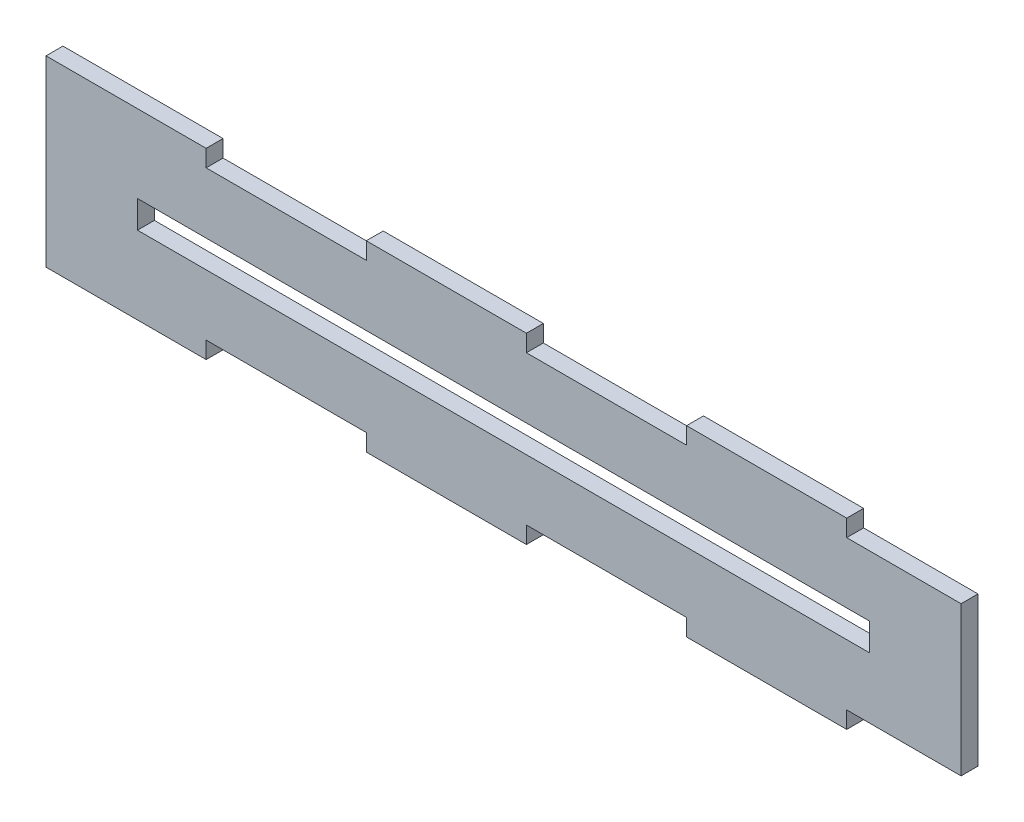
ISO-10303-21;
HEADER;
FILE_DESCRIPTION(('STEP AP214'),'2;1');
FILE_NAME('part.step','',(''),(''),'','','');
FILE_SCHEMA(('AUTOMOTIVE_DESIGN { 1 0 10303 214 1 1 1 1 }'));
ENDSEC;
DATA;
#1=APPLICATION_CONTEXT('core data for automotive mechanical design processes');
#2=APPLICATION_PROTOCOL_DEFINITION('international standard','automotive_design',2000,#1);
#3=PRODUCT_CONTEXT('',#1,'mechanical');
#4=PRODUCT('Part','Part','',(#3));
#5=PRODUCT_RELATED_PRODUCT_CATEGORY('part','',(#4));
#6=PRODUCT_DEFINITION_FORMATION('','',#4);
#7=PRODUCT_DEFINITION_CONTEXT('part definition',#1,'design');
#8=PRODUCT_DEFINITION('design','',#6,#7);
#9=PRODUCT_DEFINITION_SHAPE('','',#8);
#10=(LENGTH_UNIT() NAMED_UNIT(*) SI_UNIT(.MILLI.,.METRE.));
#11=(NAMED_UNIT(*) PLANE_ANGLE_UNIT() SI_UNIT($,.RADIAN.));
#12=(NAMED_UNIT(*) SI_UNIT($,.STERADIAN.) SOLID_ANGLE_UNIT());
#13=UNCERTAINTY_MEASURE_WITH_UNIT(LENGTH_MEASURE(1.E-05),#10,'distance_accuracy_value','');
#14=(GEOMETRIC_REPRESENTATION_CONTEXT(3) GLOBAL_UNCERTAINTY_ASSIGNED_CONTEXT((#13)) GLOBAL_UNIT_ASSIGNED_CONTEXT((#10,
#11,#12)) REPRESENTATION_CONTEXT('',''));
#15=CARTESIAN_POINT('',(0.,0.,0.));
#16=DIRECTION('',(0.,0.,1.));
#17=DIRECTION('',(1.,0.,0.));
#18=AXIS2_PLACEMENT_3D('',#15,#16,#17);
#19=CARTESIAN_POINT('',(0.,0.,0.));
#20=DIRECTION('',(0.,0.,1.));
#21=DIRECTION('',(1.,0.,0.));
#22=AXIS2_PLACEMENT_3D('',#19,#20,#21);
#23=PLANE('',#22);
#24=DIRECTION('',(-1.,0.,0.));
#25=VECTOR('',#24,1.);
#26=CARTESIAN_POINT('',(106.792884167343,-158.153737527389,0.));
#27=LINE('',#26,#25);
#28=CARTESIAN_POINT('',(309.992884167343,-158.153737527389,0.));
#29=VERTEX_POINT('',#28);
#30=CARTESIAN_POINT('',(106.792884167343,-158.153737527389,0.));
#31=VERTEX_POINT('',#30);
#32=EDGE_CURVE('E409',#29,#31,#27,.T.);
#33=ORIENTED_EDGE('',*,*,#32,.F.);
#34=DIRECTION('',(0.,-1.,0.));
#35=VECTOR('',#34,1.);
#36=CARTESIAN_POINT('',(309.992884167343,-150.533737527389,0.));
#37=LINE('',#36,#35);
#38=CARTESIAN_POINT('',(309.992884167343,-150.533737527389,0.));
#39=VERTEX_POINT('',#38);
#40=EDGE_CURVE('E393',#39,#29,#37,.T.);
#41=ORIENTED_EDGE('',*,*,#40,.F.);
#42=DIRECTION('',(1.,0.,0.));
#43=VECTOR('',#42,1.);
#44=CARTESIAN_POINT('',(106.792884167343,-150.533737527389,0.));
#45=LINE('',#44,#43);
#46=CARTESIAN_POINT('',(106.792884167343,-150.533737527389,0.));
#47=VERTEX_POINT('',#46);
#48=EDGE_CURVE('E398',#47,#39,#45,.T.);
#49=ORIENTED_EDGE('',*,*,#48,.F.);
#50=DIRECTION('',(0.,1.,0.));
#51=VECTOR('',#50,1.);
#52=CARTESIAN_POINT('',(106.792884167343,-150.533737527389,0.));
#53=LINE('',#52,#51);
#54=EDGE_CURVE('E412',#31,#47,#53,.T.);
#55=ORIENTED_EDGE('',*,*,#54,.F.);
#56=EDGE_LOOP('',(#33,#41,#49,#55));
#57=FACE_BOUND('',#56,.T.);
#58=DIRECTION('',(0.,1.,0.));
#59=VECTOR('',#58,1.);
#60=CARTESIAN_POINT('',(125.842884167343,-133.642737527389,0.));
#61=LINE('',#60,#59);
#62=CARTESIAN_POINT('',(125.842884167343,-133.642737527389,0.));
#63=VERTEX_POINT('',#62);
#64=CARTESIAN_POINT('',(125.842884167343,-128.943737527389,0.));
#65=VERTEX_POINT('',#64);
#66=EDGE_CURVE('E327',#63,#65,#61,.T.);
#67=ORIENTED_EDGE('',*,*,#66,.F.);
#68=DIRECTION('',(1.,0.,0.));
#69=VECTOR('',#68,1.);
#70=CARTESIAN_POINT('',(81.3928841673428,-133.642737527389,0.));
#71=LINE('',#70,#69);
#72=CARTESIAN_POINT('',(170.292884167343,-133.642737527389,0.));
#73=VERTEX_POINT('',#72);
#74=EDGE_CURVE('E330',#63,#73,#71,.T.);
#75=ORIENTED_EDGE('',*,*,#74,.T.);
#76=DIRECTION('',(0.,1.,0.));
#77=VECTOR('',#76,1.);
#78=CARTESIAN_POINT('',(170.292884167343,-133.642737527389,0.));
#79=LINE('',#78,#77);
#80=CARTESIAN_POINT('',(170.292884167343,-128.943737527389,0.));
#81=VERTEX_POINT('',#80);
#82=EDGE_CURVE('E315',#73,#81,#79,.T.);
#83=ORIENTED_EDGE('',*,*,#82,.T.);
#84=DIRECTION('',(1.,0.,0.));
#85=VECTOR('',#84,1.);
#86=CARTESIAN_POINT('',(81.392884167343,-128.943737527389,0.));
#87=LINE('',#86,#85);
#88=CARTESIAN_POINT('',(214.742884167343,-128.943737527389,0.));
#89=VERTEX_POINT('',#88);
#90=EDGE_CURVE('E278',#81,#89,#87,.T.);
#91=ORIENTED_EDGE('',*,*,#90,.T.);
#92=DIRECTION('',(0.,1.,0.));
#93=VECTOR('',#92,1.);
#94=CARTESIAN_POINT('',(214.742884167343,-133.642737527389,0.));
#95=LINE('',#94,#93);
#96=CARTESIAN_POINT('',(214.742884167343,-133.642737527389,0.));
#97=VERTEX_POINT('',#96);
#98=EDGE_CURVE('E319',#97,#89,#95,.T.);
#99=ORIENTED_EDGE('',*,*,#98,.F.);
#100=CARTESIAN_POINT('',(259.192884167343,-133.642737527389,0.));
#101=VERTEX_POINT('',#100);
#102=EDGE_CURVE('E299',#97,#101,#71,.T.);
#103=ORIENTED_EDGE('',*,*,#102,.T.);
#104=DIRECTION('',(0.,1.,0.));
#105=VECTOR('',#104,1.);
#106=CARTESIAN_POINT('',(259.192884167343,-133.642737527389,0.));
#107=LINE('',#106,#105);
#108=CARTESIAN_POINT('',(259.192884167343,-128.943737527389,0.));
#109=VERTEX_POINT('',#108);
#110=EDGE_CURVE('E312',#101,#109,#107,.T.);
#111=ORIENTED_EDGE('',*,*,#110,.T.);
#112=CARTESIAN_POINT('',(303.642884167343,-128.943737527389,0.));
#113=VERTEX_POINT('',#112);
#114=EDGE_CURVE('E273',#109,#113,#87,.T.);
#115=ORIENTED_EDGE('',*,*,#114,.T.);
#116=DIRECTION('',(0.,1.,0.));
#117=VECTOR('',#116,1.);
#118=CARTESIAN_POINT('',(303.642884167343,-133.642737527389,0.));
#119=LINE('',#118,#117);
#120=CARTESIAN_POINT('',(303.642884167343,-133.642737527389,0.));
#121=VERTEX_POINT('',#120);
#122=EDGE_CURVE('E228',#121,#113,#119,.T.);
#123=ORIENTED_EDGE('',*,*,#122,.F.);
#124=CARTESIAN_POINT('',(335.392884167343,-133.642737527389,0.));
#125=VERTEX_POINT('',#124);
#126=EDGE_CURVE('E235',#121,#125,#71,.T.);
#127=ORIENTED_EDGE('',*,*,#126,.T.);
#128=DIRECTION('',(0.,-1.,0.));
#129=VECTOR('',#128,1.);
#130=CARTESIAN_POINT('',(335.392884167343,-128.943737527389,0.));
#131=LINE('',#130,#129);
#132=CARTESIAN_POINT('',(335.392884167343,-175.044737527389,0.));
#133=VERTEX_POINT('',#132);
#134=EDGE_CURVE('E270',#125,#133,#131,.T.);
#135=ORIENTED_EDGE('',*,*,#134,.T.);
#136=DIRECTION('',(1.,0.,0.));
#137=VECTOR('',#136,1.);
#138=CARTESIAN_POINT('',(81.392884167343,-175.044737527389,0.));
#139=LINE('',#138,#137);
#140=CARTESIAN_POINT('',(303.642884167343,-175.044737527389,0.));
#141=VERTEX_POINT('',#140);
#142=EDGE_CURVE('E382',#141,#133,#139,.T.);
#143=ORIENTED_EDGE('',*,*,#142,.F.);
#144=DIRECTION('',(0.,1.,0.));
#145=VECTOR('',#144,1.);
#146=CARTESIAN_POINT('',(303.642884167343,-179.743737527389,0.));
#147=LINE('',#146,#145);
#148=CARTESIAN_POINT('',(303.642884167343,-179.743737527389,0.));
#149=VERTEX_POINT('',#148);
#150=EDGE_CURVE('E349',#149,#141,#147,.T.);
#151=ORIENTED_EDGE('',*,*,#150,.F.);
#152=DIRECTION('',(1.,0.,0.));
#153=VECTOR('',#152,1.);
#154=CARTESIAN_POINT('',(81.392884167343,-179.743737527389,0.));
#155=LINE('',#154,#153);
#156=CARTESIAN_POINT('',(259.192884167343,-179.743737527389,0.));
#157=VERTEX_POINT('',#156);
#158=EDGE_CURVE('E265',#157,#149,#155,.T.);
#159=ORIENTED_EDGE('',*,*,#158,.F.);
#160=DIRECTION('',(0.,1.,0.));
#161=VECTOR('',#160,1.);
#162=CARTESIAN_POINT('',(259.192884167343,-179.743737527389,0.));
#163=LINE('',#162,#161);
#164=CARTESIAN_POINT('',(259.192884167343,-175.044737527389,0.));
#165=VERTEX_POINT('',#164);
#166=EDGE_CURVE('E345',#157,#165,#163,.T.);
#167=ORIENTED_EDGE('',*,*,#166,.T.);
#168=CARTESIAN_POINT('',(214.742884167343,-175.044737527389,0.));
#169=VERTEX_POINT('',#168);
#170=EDGE_CURVE('E388',#169,#165,#139,.T.);
#171=ORIENTED_EDGE('',*,*,#170,.F.);
#172=DIRECTION('',(0.,1.,0.));
#173=VECTOR('',#172,1.);
#174=CARTESIAN_POINT('',(214.742884167343,-179.743737527389,0.));
#175=LINE('',#174,#173);
#176=CARTESIAN_POINT('',(214.742884167343,-179.743737527389,0.));
#177=VERTEX_POINT('',#176);
#178=EDGE_CURVE('E368',#177,#169,#175,.T.);
#179=ORIENTED_EDGE('',*,*,#178,.F.);
#180=CARTESIAN_POINT('',(170.292884167343,-179.743737527389,0.));
#181=VERTEX_POINT('',#180);
#182=EDGE_CURVE('E271',#181,#177,#155,.T.);
#183=ORIENTED_EDGE('',*,*,#182,.F.);
#184=DIRECTION('',(0.,1.,0.));
#185=VECTOR('',#184,1.);
#186=CARTESIAN_POINT('',(170.292884167343,-179.743737527389,0.));
#187=LINE('',#186,#185);
#188=CARTESIAN_POINT('',(170.292884167343,-175.044737527389,0.));
#189=VERTEX_POINT('',#188);
#190=EDGE_CURVE('E364',#181,#189,#187,.T.);
#191=ORIENTED_EDGE('',*,*,#190,.T.);
#192=CARTESIAN_POINT('',(125.842884167343,-175.044737527389,0.));
#193=VERTEX_POINT('',#192);
#194=EDGE_CURVE('E385',#193,#189,#139,.T.);
#195=ORIENTED_EDGE('',*,*,#194,.F.);
#196=DIRECTION('',(0.,1.,0.));
#197=VECTOR('',#196,1.);
#198=CARTESIAN_POINT('',(125.842884167343,-179.743737527389,0.));
#199=LINE('',#198,#197);
#200=CARTESIAN_POINT('',(125.842884167343,-179.743737527389,0.));
#201=VERTEX_POINT('',#200);
#202=EDGE_CURVE('E379',#201,#193,#199,.T.);
#203=ORIENTED_EDGE('',*,*,#202,.F.);
#204=CARTESIAN_POINT('',(81.392884167343,-179.743737527389,0.));
#205=VERTEX_POINT('',#204);
#206=EDGE_CURVE('E267',#205,#201,#155,.T.);
#207=ORIENTED_EDGE('',*,*,#206,.F.);
#208=DIRECTION('',(0.,-1.,0.));
#209=VECTOR('',#208,1.);
#210=CARTESIAN_POINT('',(81.392884167343,-128.943737527389,0.));
#211=LINE('',#210,#209);
#212=CARTESIAN_POINT('',(81.392884167343,-128.943737527389,0.));
#213=VERTEX_POINT('',#212);
#214=EDGE_CURVE('E262',#213,#205,#211,.T.);
#215=ORIENTED_EDGE('',*,*,#214,.F.);
#216=EDGE_CURVE('E274',#213,#65,#87,.T.);
#217=ORIENTED_EDGE('',*,*,#216,.T.);
#218=EDGE_LOOP('',(#67,#75,#83,#91,#99,#103,#111,#115,#123,#127,#135,#143,#151,#159,#167,#171,
#179,#183,#191,#195,#203,#207,#215,#217));
#219=FACE_BOUND('',#218,.T.);
#220=ADVANCED_FACE('F33',(#57,#219),#23,.F.);
#221=CARTESIAN_POINT('',(335.392884167343,-128.943737527389,4.699));
#222=DIRECTION('',(1.,0.,0.));
#223=DIRECTION('',(0.,0.,-1.));
#224=AXIS2_PLACEMENT_3D('',#221,#222,#223);
#225=PLANE('',#224);
#226=ORIENTED_EDGE('',*,*,#134,.F.);
#227=DIRECTION('',(0.,0.,1.));
#228=VECTOR('',#227,1.);
#229=CARTESIAN_POINT('',(335.392884167343,-133.642737527389,4.699));
#230=LINE('',#229,#228);
#231=CARTESIAN_POINT('',(335.392884167343,-133.642737527389,4.699));
#232=VERTEX_POINT('',#231);
#233=EDGE_CURVE('E333',#125,#232,#230,.T.);
#234=ORIENTED_EDGE('',*,*,#233,.T.);
#235=DIRECTION('',(0.,-1.,0.));
#236=VECTOR('',#235,1.);
#237=CARTESIAN_POINT('',(335.392884167343,-128.943737527389,4.699));
#238=LINE('',#237,#236);
#239=CARTESIAN_POINT('',(335.392884167343,-175.044737527389,4.699));
#240=VERTEX_POINT('',#239);
#241=EDGE_CURVE('E242',#232,#240,#238,.T.);
#242=ORIENTED_EDGE('',*,*,#241,.T.);
#243=DIRECTION('',(0.,0.,1.));
#244=VECTOR('',#243,1.);
#245=CARTESIAN_POINT('',(335.392884167343,-175.044737527389,4.699));
#246=LINE('',#245,#244);
#247=EDGE_CURVE('E391',#133,#240,#246,.T.);
#248=ORIENTED_EDGE('',*,*,#247,.F.);
#249=EDGE_LOOP('',(#226,#234,#242,#248));
#250=FACE_BOUND('',#249,.T.);
#251=ADVANCED_FACE('F456',(#250),#225,.T.);
#252=CARTESIAN_POINT('',(81.392884167343,-128.943737527389,4.699));
#253=DIRECTION('',(0.,1.,0.));
#254=DIRECTION('',(0.,0.,1.));
#255=AXIS2_PLACEMENT_3D('',#252,#253,#254);
#256=PLANE('',#255);
#257=DIRECTION('',(1.,0.,0.));
#258=VECTOR('',#257,1.);
#259=CARTESIAN_POINT('',(81.392884167343,-128.943737527389,4.699));
#260=LINE('',#259,#258);
#261=CARTESIAN_POINT('',(81.392884167343,-128.943737527389,4.699));
#262=VERTEX_POINT('',#261);
#263=CARTESIAN_POINT('',(125.842884167343,-128.943737527389,4.69899999999998));
#264=VERTEX_POINT('',#263);
#265=EDGE_CURVE('E253',#262,#264,#260,.T.);
#266=ORIENTED_EDGE('',*,*,#265,.T.);
#267=DIRECTION('',(0.,0.,-1.));
#268=VECTOR('',#267,1.);
#269=CARTESIAN_POINT('',(125.842884167343,-128.943737527389,0.));
#270=LINE('',#269,#268);
#271=EDGE_CURVE('E318',#264,#65,#270,.T.);
#272=ORIENTED_EDGE('',*,*,#271,.T.);
#273=ORIENTED_EDGE('',*,*,#216,.F.);
#274=DIRECTION('',(0.,0.,-1.));
#275=VECTOR('',#274,1.);
#276=CARTESIAN_POINT('',(81.392884167343,-128.943737527389,4.699));
#277=LINE('',#276,#275);
#278=EDGE_CURVE('E261',#262,#213,#277,.T.);
#279=ORIENTED_EDGE('',*,*,#278,.F.);
#280=EDGE_LOOP('',(#266,#272,#273,#279));
#281=FACE_BOUND('',#280,.T.);
#282=ADVANCED_FACE('F473',(#281),#256,.T.);
#283=ORIENTED_EDGE('',*,*,#90,.F.);
#284=DIRECTION('',(0.,0.,1.));
#285=VECTOR('',#284,1.);
#286=CARTESIAN_POINT('',(170.292884167343,-128.943737527389,0.));
#287=LINE('',#286,#285);
#288=CARTESIAN_POINT('',(170.292884167343,-128.943737527389,4.69899999999997));
#289=VERTEX_POINT('',#288);
#290=EDGE_CURVE('E309',#81,#289,#287,.T.);
#291=ORIENTED_EDGE('',*,*,#290,.T.);
#292=CARTESIAN_POINT('',(214.742884167343,-128.943737527389,4.69899999999997));
#293=VERTEX_POINT('',#292);
#294=EDGE_CURVE('E251',#289,#293,#260,.T.);
#295=ORIENTED_EDGE('',*,*,#294,.T.);
#296=DIRECTION('',(0.,0.,-1.));
#297=VECTOR('',#296,1.);
#298=CARTESIAN_POINT('',(214.742884167343,-128.943737527389,0.));
#299=LINE('',#298,#297);
#300=EDGE_CURVE('E305',#293,#89,#299,.T.);
#301=ORIENTED_EDGE('',*,*,#300,.T.);
#302=EDGE_LOOP('',(#283,#291,#295,#301));
#303=FACE_BOUND('',#302,.T.);
#304=ADVANCED_FACE('F464',(#303),#256,.T.);
#305=ORIENTED_EDGE('',*,*,#114,.F.);
#306=DIRECTION('',(0.,0.,1.));
#307=VECTOR('',#306,1.);
#308=CARTESIAN_POINT('',(259.192884167343,-128.943737527389,0.));
#309=LINE('',#308,#307);
#310=CARTESIAN_POINT('',(259.192884167343,-128.943737527389,4.69899999999996));
#311=VERTEX_POINT('',#310);
#312=EDGE_CURVE('E643',#109,#311,#309,.T.);
#313=ORIENTED_EDGE('',*,*,#312,.T.);
#314=CARTESIAN_POINT('',(303.642884167343,-128.943737527389,4.699));
#315=VERTEX_POINT('',#314);
#316=EDGE_CURVE('E248',#311,#315,#260,.T.);
#317=ORIENTED_EDGE('',*,*,#316,.T.);
#318=DIRECTION('',(0.,0.,-1.));
#319=VECTOR('',#318,1.);
#320=CARTESIAN_POINT('',(303.642884167343,-128.943737527389,0.));
#321=LINE('',#320,#319);
#322=EDGE_CURVE('E224',#315,#113,#321,.T.);
#323=ORIENTED_EDGE('',*,*,#322,.T.);
#324=EDGE_LOOP('',(#305,#313,#317,#323));
#325=FACE_BOUND('',#324,.T.);
#326=ADVANCED_FACE('F511',(#325),#256,.T.);
#327=CARTESIAN_POINT('',(81.392884167343,-179.743737527389,4.699));
#328=DIRECTION('',(0.,1.,0.));
#329=DIRECTION('',(0.,0.,1.));
#330=AXIS2_PLACEMENT_3D('',#327,#328,#329);
#331=PLANE('',#330);
#332=DIRECTION('',(0.,0.,-1.));
#333=VECTOR('',#332,1.);
#334=CARTESIAN_POINT('',(125.842884167343,-179.743737527389,0.));
#335=LINE('',#334,#333);
#336=CARTESIAN_POINT('',(125.842884167343,-179.743737527389,4.69899999999999));
#337=VERTEX_POINT('',#336);
#338=EDGE_CURVE('E375',#337,#201,#335,.T.);
#339=ORIENTED_EDGE('',*,*,#338,.F.);
#340=DIRECTION('',(1.,0.,0.));
#341=VECTOR('',#340,1.);
#342=CARTESIAN_POINT('',(81.392884167343,-179.743737527389,4.699));
#343=LINE('',#342,#341);
#344=CARTESIAN_POINT('',(81.392884167343,-179.743737527389,4.699));
#345=VERTEX_POINT('',#344);
#346=EDGE_CURVE('E249',#345,#337,#343,.T.);
#347=ORIENTED_EDGE('',*,*,#346,.F.);
#348=DIRECTION('',(0.,0.,-1.));
#349=VECTOR('',#348,1.);
#350=CARTESIAN_POINT('',(81.392884167343,-179.743737527389,4.699));
#351=LINE('',#350,#349);
#352=EDGE_CURVE('E279',#345,#205,#351,.T.);
#353=ORIENTED_EDGE('',*,*,#352,.T.);
#354=ORIENTED_EDGE('',*,*,#206,.T.);
#355=EDGE_LOOP('',(#339,#347,#353,#354));
#356=FACE_BOUND('',#355,.T.);
#357=ADVANCED_FACE('F480',(#356),#331,.F.);
#358=DIRECTION('',(0.,0.,1.));
#359=VECTOR('',#358,1.);
#360=CARTESIAN_POINT('',(170.292884167343,-179.743737527389,0.));
#361=LINE('',#360,#359);
#362=CARTESIAN_POINT('',(170.292884167343,-179.743737527389,4.69899999999999));
#363=VERTEX_POINT('',#362);
#364=EDGE_CURVE('E355',#181,#363,#361,.T.);
#365=ORIENTED_EDGE('',*,*,#364,.F.);
#366=ORIENTED_EDGE('',*,*,#182,.T.);
#367=DIRECTION('',(0.,0.,-1.));
#368=VECTOR('',#367,1.);
#369=CARTESIAN_POINT('',(214.742884167343,-179.743737527389,0.));
#370=LINE('',#369,#368);
#371=CARTESIAN_POINT('',(214.742884167343,-179.743737527389,4.69899999999998));
#372=VERTEX_POINT('',#371);
#373=EDGE_CURVE('E357',#372,#177,#370,.T.);
#374=ORIENTED_EDGE('',*,*,#373,.F.);
#375=EDGE_CURVE('E255',#363,#372,#343,.T.);
#376=ORIENTED_EDGE('',*,*,#375,.F.);
#377=EDGE_LOOP('',(#365,#366,#374,#376));
#378=FACE_BOUND('',#377,.T.);
#379=ADVANCED_FACE('F436',(#378),#331,.F.);
#380=DIRECTION('',(0.,0.,1.));
#381=VECTOR('',#380,1.);
#382=CARTESIAN_POINT('',(259.192884167343,-179.743737527389,0.));
#383=LINE('',#382,#381);
#384=CARTESIAN_POINT('',(259.192884167343,-179.743737527389,4.69899999999998));
#385=VERTEX_POINT('',#384);
#386=EDGE_CURVE('E336',#157,#385,#383,.T.);
#387=ORIENTED_EDGE('',*,*,#386,.F.);
#388=ORIENTED_EDGE('',*,*,#158,.T.);
#389=DIRECTION('',(0.,0.,-1.));
#390=VECTOR('',#389,1.);
#391=CARTESIAN_POINT('',(303.642884167343,-179.743737527389,0.));
#392=LINE('',#391,#390);
#393=CARTESIAN_POINT('',(303.642884167343,-179.743737527389,4.69899999999997));
#394=VERTEX_POINT('',#393);
#395=EDGE_CURVE('E338',#394,#149,#392,.T.);
#396=ORIENTED_EDGE('',*,*,#395,.F.);
#397=EDGE_CURVE('E257',#385,#394,#343,.T.);
#398=ORIENTED_EDGE('',*,*,#397,.F.);
#399=EDGE_LOOP('',(#387,#388,#396,#398));
#400=FACE_BOUND('',#399,.T.);
#401=ADVANCED_FACE('F513',(#400),#331,.F.);
#402=CARTESIAN_POINT('',(81.392884167343,-128.943737527389,4.699));
#403=DIRECTION('',(1.,0.,0.));
#404=DIRECTION('',(0.,1.,0.));
#405=AXIS2_PLACEMENT_3D('',#402,#403,#404);
#406=PLANE('',#405);
#407=ORIENTED_EDGE('',*,*,#214,.T.);
#408=ORIENTED_EDGE('',*,*,#352,.F.);
#409=DIRECTION('',(0.,-1.,0.));
#410=VECTOR('',#409,1.);
#411=CARTESIAN_POINT('',(81.392884167343,-128.943737527389,4.699));
#412=LINE('',#411,#410);
#413=EDGE_CURVE('E277',#262,#345,#412,.T.);
#414=ORIENTED_EDGE('',*,*,#413,.F.);
#415=ORIENTED_EDGE('',*,*,#278,.T.);
#416=EDGE_LOOP('',(#407,#408,#414,#415));
#417=FACE_BOUND('',#416,.T.);
#418=ADVANCED_FACE('F35',(#417),#406,.F.);
#419=CARTESIAN_POINT('',(0.,0.,4.699));
#420=DIRECTION('',(0.,0.,1.));
#421=DIRECTION('',(1.,0.,0.));
#422=AXIS2_PLACEMENT_3D('',#419,#420,#421);
#423=PLANE('',#422);
#424=ORIENTED_EDGE('',*,*,#413,.T.);
#425=ORIENTED_EDGE('',*,*,#346,.T.);
#426=DIRECTION('',(0.,1.,0.));
#427=VECTOR('',#426,1.);
#428=CARTESIAN_POINT('',(125.842884167343,-179.743737527389,4.69899999999999));
#429=LINE('',#428,#427);
#430=CARTESIAN_POINT('',(125.842884167343,-175.044737527389,4.69899999999999));
#431=VERTEX_POINT('',#430);
#432=EDGE_CURVE('E377',#337,#431,#429,.T.);
#433=ORIENTED_EDGE('',*,*,#432,.T.);
#434=DIRECTION('',(-1.,0.,0.));
#435=VECTOR('',#434,1.);
#436=CARTESIAN_POINT('',(0.,-175.044737527389,4.699));
#437=LINE('',#436,#435);
#438=CARTESIAN_POINT('',(170.292884167343,-175.044737527389,4.69899999999999));
#439=VERTEX_POINT('',#438);
#440=EDGE_CURVE('E387',#439,#431,#437,.T.);
#441=ORIENTED_EDGE('',*,*,#440,.F.);
#442=DIRECTION('',(0.,1.,0.));
#443=VECTOR('',#442,1.);
#444=CARTESIAN_POINT('',(170.292884167343,-179.743737527389,4.69899999999999));
#445=LINE('',#444,#443);
#446=EDGE_CURVE('E360',#363,#439,#445,.T.);
#447=ORIENTED_EDGE('',*,*,#446,.F.);
#448=ORIENTED_EDGE('',*,*,#375,.T.);
#449=DIRECTION('',(0.,1.,0.));
#450=VECTOR('',#449,1.);
#451=CARTESIAN_POINT('',(214.742884167343,-179.743737527389,4.69899999999998));
#452=LINE('',#451,#450);
#453=CARTESIAN_POINT('',(214.742884167343,-175.044737527389,4.69899999999998));
#454=VERTEX_POINT('',#453);
#455=EDGE_CURVE('E371',#372,#454,#452,.T.);
#456=ORIENTED_EDGE('',*,*,#455,.T.);
#457=CARTESIAN_POINT('',(259.192884167343,-175.044737527389,4.69899999999998));
#458=VERTEX_POINT('',#457);
#459=EDGE_CURVE('E390',#458,#454,#437,.T.);
#460=ORIENTED_EDGE('',*,*,#459,.F.);
#461=DIRECTION('',(0.,1.,0.));
#462=VECTOR('',#461,1.);
#463=CARTESIAN_POINT('',(259.192884167343,-179.743737527389,4.69899999999998));
#464=LINE('',#463,#462);
#465=EDGE_CURVE('E341',#385,#458,#464,.T.);
#466=ORIENTED_EDGE('',*,*,#465,.F.);
#467=ORIENTED_EDGE('',*,*,#397,.T.);
#468=DIRECTION('',(0.,1.,0.));
#469=VECTOR('',#468,1.);
#470=CARTESIAN_POINT('',(303.642884167343,-179.743737527389,4.69899999999997));
#471=LINE('',#470,#469);
#472=CARTESIAN_POINT('',(303.642884167343,-175.044737527389,4.69899999999997));
#473=VERTEX_POINT('',#472);
#474=EDGE_CURVE('E352',#394,#473,#471,.T.);
#475=ORIENTED_EDGE('',*,*,#474,.T.);
#476=EDGE_CURVE('E244',#240,#473,#437,.T.);
#477=ORIENTED_EDGE('',*,*,#476,.F.);
#478=ORIENTED_EDGE('',*,*,#241,.F.);
#479=DIRECTION('',(-1.,0.,0.));
#480=VECTOR('',#479,1.);
#481=CARTESIAN_POINT('',(0.,-133.642737527389,4.699));
#482=LINE('',#481,#480);
#483=CARTESIAN_POINT('',(303.642884167343,-133.642737527389,4.69899999999996));
#484=VERTEX_POINT('',#483);
#485=EDGE_CURVE('E11',#232,#484,#482,.T.);
#486=ORIENTED_EDGE('',*,*,#485,.T.);
#487=DIRECTION('',(0.,1.,0.));
#488=VECTOR('',#487,1.);
#489=CARTESIAN_POINT('',(303.642884167343,-133.642737527389,4.69899999999996));
#490=LINE('',#489,#488);
#491=EDGE_CURVE('E218',#484,#315,#490,.T.);
#492=ORIENTED_EDGE('',*,*,#491,.T.);
#493=ORIENTED_EDGE('',*,*,#316,.F.);
#494=DIRECTION('',(0.,1.,0.));
#495=VECTOR('',#494,1.);
#496=CARTESIAN_POINT('',(259.192884167343,-133.642737527389,4.69899999999996));
#497=LINE('',#496,#495);
#498=CARTESIAN_POINT('',(259.192884167343,-133.642737527389,4.699));
#499=VERTEX_POINT('',#498);
#500=EDGE_CURVE('E229',#499,#311,#497,.T.);
#501=ORIENTED_EDGE('',*,*,#500,.F.);
#502=CARTESIAN_POINT('',(214.742884167343,-133.642737527389,4.69899999999997));
#503=VERTEX_POINT('',#502);
#504=EDGE_CURVE('E41',#499,#503,#482,.T.);
#505=ORIENTED_EDGE('',*,*,#504,.T.);
#506=DIRECTION('',(0.,1.,0.));
#507=VECTOR('',#506,1.);
#508=CARTESIAN_POINT('',(214.742884167343,-133.642737527389,4.69899999999997));
#509=LINE('',#508,#507);
#510=EDGE_CURVE('E291',#503,#293,#509,.T.);
#511=ORIENTED_EDGE('',*,*,#510,.T.);
#512=ORIENTED_EDGE('',*,*,#294,.F.);
#513=DIRECTION('',(0.,1.,0.));
#514=VECTOR('',#513,1.);
#515=CARTESIAN_POINT('',(170.292884167343,-133.642737527389,4.69899999999997));
#516=LINE('',#515,#514);
#517=CARTESIAN_POINT('',(170.292884167343,-133.642737527389,4.699));
#518=VERTEX_POINT('',#517);
#519=EDGE_CURVE('E302',#518,#289,#516,.T.);
#520=ORIENTED_EDGE('',*,*,#519,.F.);
#521=CARTESIAN_POINT('',(125.842884167343,-133.642737527389,4.69899999999998));
#522=VERTEX_POINT('',#521);
#523=EDGE_CURVE('E42',#518,#522,#482,.T.);
#524=ORIENTED_EDGE('',*,*,#523,.T.);
#525=DIRECTION('',(0.,1.,0.));
#526=VECTOR('',#525,1.);
#527=CARTESIAN_POINT('',(125.842884167343,-133.642737527389,4.69899999999998));
#528=LINE('',#527,#526);
#529=EDGE_CURVE('E324',#522,#264,#528,.T.);
#530=ORIENTED_EDGE('',*,*,#529,.T.);
#531=ORIENTED_EDGE('',*,*,#265,.F.);
#532=EDGE_LOOP('',(#424,#425,#433,#441,#447,#448,#456,#460,#466,#467,#475,#477,#478,#486,#492,
#493,#501,#505,#511,#512,#520,#524,#530,#531));
#533=FACE_BOUND('',#532,.T.);
#534=DIRECTION('',(0.,-1.,0.));
#535=VECTOR('',#534,1.);
#536=CARTESIAN_POINT('',(309.992884167343,-150.533737527389,4.699));
#537=LINE('',#536,#535);
#538=CARTESIAN_POINT('',(309.992884167343,-150.533737527389,4.699));
#539=VERTEX_POINT('',#538);
#540=CARTESIAN_POINT('',(309.992884167343,-158.153737527389,4.699));
#541=VERTEX_POINT('',#540);
#542=EDGE_CURVE('E394',#539,#541,#537,.T.);
#543=ORIENTED_EDGE('',*,*,#542,.T.);
#544=DIRECTION('',(-1.,0.,0.));
#545=VECTOR('',#544,1.);
#546=CARTESIAN_POINT('',(106.792884167343,-158.153737527389,4.699));
#547=LINE('',#546,#545);
#548=CARTESIAN_POINT('',(106.792884167343,-158.153737527389,4.699));
#549=VERTEX_POINT('',#548);
#550=EDGE_CURVE('E397',#541,#549,#547,.T.);
#551=ORIENTED_EDGE('',*,*,#550,.T.);
#552=DIRECTION('',(0.,1.,0.));
#553=VECTOR('',#552,1.);
#554=CARTESIAN_POINT('',(106.792884167343,-150.533737527389,4.699));
#555=LINE('',#554,#553);
#556=CARTESIAN_POINT('',(106.792884167343,-150.533737527389,4.699));
#557=VERTEX_POINT('',#556);
#558=EDGE_CURVE('E401',#549,#557,#555,.T.);
#559=ORIENTED_EDGE('',*,*,#558,.T.);
#560=DIRECTION('',(1.,0.,0.));
#561=VECTOR('',#560,1.);
#562=CARTESIAN_POINT('',(106.792884167343,-150.533737527389,4.699));
#563=LINE('',#562,#561);
#564=EDGE_CURVE('E404',#557,#539,#563,.T.);
#565=ORIENTED_EDGE('',*,*,#564,.T.);
#566=EDGE_LOOP('',(#543,#551,#559,#565));
#567=FACE_BOUND('',#566,.T.);
#568=ADVANCED_FACE('F239',(#533,#567),#423,.T.);
#569=CARTESIAN_POINT('',(309.992884167343,-150.533737527389,4.699));
#570=DIRECTION('',(1.,0.,0.));
#571=DIRECTION('',(0.,1.,0.));
#572=AXIS2_PLACEMENT_3D('',#569,#570,#571);
#573=PLANE('',#572);
#574=ORIENTED_EDGE('',*,*,#40,.T.);
#575=DIRECTION('',(0.,0.,-1.));
#576=VECTOR('',#575,1.);
#577=CARTESIAN_POINT('',(309.992884167343,-158.153737527389,4.699));
#578=LINE('',#577,#576);
#579=EDGE_CURVE('E407',#541,#29,#578,.T.);
#580=ORIENTED_EDGE('',*,*,#579,.F.);
#581=ORIENTED_EDGE('',*,*,#542,.F.);
#582=DIRECTION('',(0.,0.,-1.));
#583=VECTOR('',#582,1.);
#584=CARTESIAN_POINT('',(309.992884167343,-150.533737527389,4.699));
#585=LINE('',#584,#583);
#586=EDGE_CURVE('E266',#539,#39,#585,.T.);
#587=ORIENTED_EDGE('',*,*,#586,.T.);
#588=EDGE_LOOP('',(#574,#580,#581,#587));
#589=FACE_BOUND('',#588,.T.);
#590=ADVANCED_FACE('F719',(#589),#573,.F.);
#591=CARTESIAN_POINT('',(106.792884167343,-150.533737527389,4.699));
#592=DIRECTION('',(0.,1.,0.));
#593=DIRECTION('',(0.,0.,1.));
#594=AXIS2_PLACEMENT_3D('',#591,#592,#593);
#595=PLANE('',#594);
#596=ORIENTED_EDGE('',*,*,#48,.T.);
#597=ORIENTED_EDGE('',*,*,#586,.F.);
#598=ORIENTED_EDGE('',*,*,#564,.F.);
#599=DIRECTION('',(0.,0.,-1.));
#600=VECTOR('',#599,1.);
#601=CARTESIAN_POINT('',(106.792884167343,-150.533737527389,4.699));
#602=LINE('',#601,#600);
#603=EDGE_CURVE('E418',#557,#47,#602,.T.);
#604=ORIENTED_EDGE('',*,*,#603,.T.);
#605=EDGE_LOOP('',(#596,#597,#598,#604));
#606=FACE_BOUND('',#605,.T.);
#607=ADVANCED_FACE('F710',(#606),#595,.F.);
#608=CARTESIAN_POINT('',(106.792884167343,-150.533737527389,4.699));
#609=DIRECTION('',(-1.,0.,0.));
#610=DIRECTION('',(0.,0.,1.));
#611=AXIS2_PLACEMENT_3D('',#608,#609,#610);
#612=PLANE('',#611);
#613=ORIENTED_EDGE('',*,*,#54,.T.);
#614=ORIENTED_EDGE('',*,*,#603,.F.);
#615=ORIENTED_EDGE('',*,*,#558,.F.);
#616=DIRECTION('',(0.,0.,-1.));
#617=VECTOR('',#616,1.);
#618=CARTESIAN_POINT('',(106.792884167343,-158.153737527389,4.699));
#619=LINE('',#618,#617);
#620=EDGE_CURVE('E420',#549,#31,#619,.T.);
#621=ORIENTED_EDGE('',*,*,#620,.T.);
#622=EDGE_LOOP('',(#613,#614,#615,#621));
#623=FACE_BOUND('',#622,.T.);
#624=ADVANCED_FACE('F540',(#623),#612,.F.);
#625=CARTESIAN_POINT('',(106.792884167343,-158.153737527389,4.699));
#626=DIRECTION('',(0.,-1.,0.));
#627=DIRECTION('',(1.,0.,0.));
#628=AXIS2_PLACEMENT_3D('',#625,#626,#627);
#629=PLANE('',#628);
#630=ORIENTED_EDGE('',*,*,#32,.T.);
#631=ORIENTED_EDGE('',*,*,#620,.F.);
#632=ORIENTED_EDGE('',*,*,#550,.F.);
#633=ORIENTED_EDGE('',*,*,#579,.T.);
#634=EDGE_LOOP('',(#630,#631,#632,#633));
#635=FACE_BOUND('',#634,.T.);
#636=ADVANCED_FACE('F531',(#635),#629,.F.);
#637=CARTESIAN_POINT('',(303.642884167343,-179.743737527389,0.));
#638=DIRECTION('',(1.,0.,0.));
#639=DIRECTION('',(0.,1.,0.));
#640=AXIS2_PLACEMENT_3D('',#637,#638,#639);
#641=PLANE('',#640);
#642=DIRECTION('',(0.,0.,-1.));
#643=VECTOR('',#642,1.);
#644=CARTESIAN_POINT('',(303.642884167343,-175.044737527389,0.));
#645=LINE('',#644,#643);
#646=EDGE_CURVE('E339',#473,#141,#645,.T.);
#647=ORIENTED_EDGE('',*,*,#646,.F.);
#648=ORIENTED_EDGE('',*,*,#474,.F.);
#649=ORIENTED_EDGE('',*,*,#395,.T.);
#650=ORIENTED_EDGE('',*,*,#150,.T.);
#651=EDGE_LOOP('',(#647,#648,#649,#650));
#652=FACE_BOUND('',#651,.T.);
#653=ADVANCED_FACE('F529',(#652),#641,.T.);
#654=CARTESIAN_POINT('',(81.392884167343,-175.044737527389,0.));
#655=DIRECTION('',(0.,1.,0.));
#656=DIRECTION('',(-1.,0.,0.));
#657=AXIS2_PLACEMENT_3D('',#654,#655,#656);
#658=PLANE('',#657);
#659=ORIENTED_EDGE('',*,*,#247,.T.);
#660=ORIENTED_EDGE('',*,*,#476,.T.);
#661=ORIENTED_EDGE('',*,*,#646,.T.);
#662=ORIENTED_EDGE('',*,*,#142,.T.);
#663=EDGE_LOOP('',(#659,#660,#661,#662));
#664=FACE_BOUND('',#663,.T.);
#665=ADVANCED_FACE('F452',(#664),#658,.F.);
#666=CARTESIAN_POINT('',(214.742884167343,-179.743737527389,0.));
#667=DIRECTION('',(1.,0.,0.));
#668=DIRECTION('',(0.,1.,0.));
#669=AXIS2_PLACEMENT_3D('',#666,#667,#668);
#670=PLANE('',#669);
#671=DIRECTION('',(0.,0.,-1.));
#672=VECTOR('',#671,1.);
#673=CARTESIAN_POINT('',(214.742884167343,-175.044737527389,0.));
#674=LINE('',#673,#672);
#675=EDGE_CURVE('E358',#454,#169,#674,.T.);
#676=ORIENTED_EDGE('',*,*,#675,.F.);
#677=ORIENTED_EDGE('',*,*,#455,.F.);
#678=ORIENTED_EDGE('',*,*,#373,.T.);
#679=ORIENTED_EDGE('',*,*,#178,.T.);
#680=EDGE_LOOP('',(#676,#677,#678,#679));
#681=FACE_BOUND('',#680,.T.);
#682=ADVANCED_FACE('F442',(#681),#670,.T.);
#683=CARTESIAN_POINT('',(259.192884167343,-179.743737527389,0.));
#684=DIRECTION('',(-1.,0.,0.));
#685=DIRECTION('',(0.,-1.,0.));
#686=AXIS2_PLACEMENT_3D('',#683,#684,#685);
#687=PLANE('',#686);
#688=DIRECTION('',(0.,0.,1.));
#689=VECTOR('',#688,1.);
#690=CARTESIAN_POINT('',(259.192884167343,-175.044737527389,0.));
#691=LINE('',#690,#689);
#692=EDGE_CURVE('E335',#165,#458,#691,.T.);
#693=ORIENTED_EDGE('',*,*,#692,.F.);
#694=ORIENTED_EDGE('',*,*,#166,.F.);
#695=ORIENTED_EDGE('',*,*,#386,.T.);
#696=ORIENTED_EDGE('',*,*,#465,.T.);
#697=EDGE_LOOP('',(#693,#694,#695,#696));
#698=FACE_BOUND('',#697,.T.);
#699=ADVANCED_FACE('F546',(#698),#687,.T.);
#700=ORIENTED_EDGE('',*,*,#459,.T.);
#701=ORIENTED_EDGE('',*,*,#675,.T.);
#702=ORIENTED_EDGE('',*,*,#170,.T.);
#703=ORIENTED_EDGE('',*,*,#692,.T.);
#704=EDGE_LOOP('',(#700,#701,#702,#703));
#705=FACE_BOUND('',#704,.T.);
#706=ADVANCED_FACE('F538',(#705),#658,.F.);
#707=ORIENTED_EDGE('',*,*,#440,.T.);
#708=DIRECTION('',(0.,0.,-1.));
#709=VECTOR('',#708,1.);
#710=CARTESIAN_POINT('',(125.842884167343,-175.044737527389,0.));
#711=LINE('',#710,#709);
#712=EDGE_CURVE('E367',#431,#193,#711,.T.);
#713=ORIENTED_EDGE('',*,*,#712,.T.);
#714=ORIENTED_EDGE('',*,*,#194,.T.);
#715=DIRECTION('',(0.,0.,1.));
#716=VECTOR('',#715,1.);
#717=CARTESIAN_POINT('',(170.292884167343,-175.044737527389,0.));
#718=LINE('',#717,#716);
#719=EDGE_CURVE('E348',#189,#439,#718,.T.);
#720=ORIENTED_EDGE('',*,*,#719,.T.);
#721=EDGE_LOOP('',(#707,#713,#714,#720));
#722=FACE_BOUND('',#721,.T.);
#723=ADVANCED_FACE('F485',(#722),#658,.F.);
#724=CARTESIAN_POINT('',(125.842884167343,-179.743737527389,0.));
#725=DIRECTION('',(1.,0.,0.));
#726=DIRECTION('',(0.,1.,0.));
#727=AXIS2_PLACEMENT_3D('',#724,#725,#726);
#728=PLANE('',#727);
#729=ORIENTED_EDGE('',*,*,#712,.F.);
#730=ORIENTED_EDGE('',*,*,#432,.F.);
#731=ORIENTED_EDGE('',*,*,#338,.T.);
#732=ORIENTED_EDGE('',*,*,#202,.T.);
#733=EDGE_LOOP('',(#729,#730,#731,#732));
#734=FACE_BOUND('',#733,.T.);
#735=ADVANCED_FACE('F483',(#734),#728,.T.);
#736=CARTESIAN_POINT('',(170.292884167343,-179.743737527389,0.));
#737=DIRECTION('',(-1.,0.,0.));
#738=DIRECTION('',(0.,0.,-1.));
#739=AXIS2_PLACEMENT_3D('',#736,#737,#738);
#740=PLANE('',#739);
#741=ORIENTED_EDGE('',*,*,#719,.F.);
#742=ORIENTED_EDGE('',*,*,#190,.F.);
#743=ORIENTED_EDGE('',*,*,#364,.T.);
#744=ORIENTED_EDGE('',*,*,#446,.T.);
#745=EDGE_LOOP('',(#741,#742,#743,#744));
#746=FACE_BOUND('',#745,.T.);
#747=ADVANCED_FACE('F488',(#746),#740,.T.);
#748=CARTESIAN_POINT('',(303.642884167343,-133.642737527389,0.));
#749=DIRECTION('',(1.,0.,0.));
#750=DIRECTION('',(0.,1.,0.));
#751=AXIS2_PLACEMENT_3D('',#748,#749,#750);
#752=PLANE('',#751);
#753=ORIENTED_EDGE('',*,*,#322,.F.);
#754=ORIENTED_EDGE('',*,*,#491,.F.);
#755=DIRECTION('',(0.,0.,-1.));
#756=VECTOR('',#755,1.);
#757=CARTESIAN_POINT('',(303.642884167343,-133.642737527389,0.));
#758=LINE('',#757,#756);
#759=EDGE_CURVE('E221',#484,#121,#758,.T.);
#760=ORIENTED_EDGE('',*,*,#759,.T.);
#761=ORIENTED_EDGE('',*,*,#122,.T.);
#762=EDGE_LOOP('',(#753,#754,#760,#761));
#763=FACE_BOUND('',#762,.T.);
#764=ADVANCED_FACE('F220',(#763),#752,.T.);
#765=CARTESIAN_POINT('',(81.3928841673428,-133.642737527389,0.));
#766=DIRECTION('',(0.,1.,0.));
#767=DIRECTION('',(-1.,0.,0.));
#768=AXIS2_PLACEMENT_3D('',#765,#766,#767);
#769=PLANE('',#768);
#770=ORIENTED_EDGE('',*,*,#126,.F.);
#771=ORIENTED_EDGE('',*,*,#759,.F.);
#772=ORIENTED_EDGE('',*,*,#485,.F.);
#773=ORIENTED_EDGE('',*,*,#233,.F.);
#774=EDGE_LOOP('',(#770,#771,#772,#773));
#775=FACE_BOUND('',#774,.T.);
#776=ADVANCED_FACE('F232',(#775),#769,.T.);
#777=CARTESIAN_POINT('',(214.742884167343,-133.642737527389,0.));
#778=DIRECTION('',(1.,0.,0.));
#779=DIRECTION('',(0.,1.,0.));
#780=AXIS2_PLACEMENT_3D('',#777,#778,#779);
#781=PLANE('',#780);
#782=ORIENTED_EDGE('',*,*,#300,.F.);
#783=ORIENTED_EDGE('',*,*,#510,.F.);
#784=DIRECTION('',(0.,0.,-1.));
#785=VECTOR('',#784,1.);
#786=CARTESIAN_POINT('',(214.742884167343,-133.642737527389,0.));
#787=LINE('',#786,#785);
#788=EDGE_CURVE('E297',#503,#97,#787,.T.);
#789=ORIENTED_EDGE('',*,*,#788,.T.);
#790=ORIENTED_EDGE('',*,*,#98,.T.);
#791=EDGE_LOOP('',(#782,#783,#789,#790));
#792=FACE_BOUND('',#791,.T.);
#793=ADVANCED_FACE('F462',(#792),#781,.T.);
#794=CARTESIAN_POINT('',(259.192884167343,-133.642737527389,0.));
#795=DIRECTION('',(-1.,0.,0.));
#796=DIRECTION('',(0.,-1.,0.));
#797=AXIS2_PLACEMENT_3D('',#794,#795,#796);
#798=PLANE('',#797);
#799=ORIENTED_EDGE('',*,*,#312,.F.);
#800=ORIENTED_EDGE('',*,*,#110,.F.);
#801=DIRECTION('',(0.,0.,1.));
#802=VECTOR('',#801,1.);
#803=CARTESIAN_POINT('',(259.192884167343,-133.642737527389,0.));
#804=LINE('',#803,#802);
#805=EDGE_CURVE('E57',#101,#499,#804,.T.);
#806=ORIENTED_EDGE('',*,*,#805,.T.);
#807=ORIENTED_EDGE('',*,*,#500,.T.);
#808=EDGE_LOOP('',(#799,#800,#806,#807));
#809=FACE_BOUND('',#808,.T.);
#810=ADVANCED_FACE('F604',(#809),#798,.T.);
#811=ORIENTED_EDGE('',*,*,#805,.F.);
#812=ORIENTED_EDGE('',*,*,#102,.F.);
#813=ORIENTED_EDGE('',*,*,#788,.F.);
#814=ORIENTED_EDGE('',*,*,#504,.F.);
#815=EDGE_LOOP('',(#811,#812,#813,#814));
#816=FACE_BOUND('',#815,.T.);
#817=ADVANCED_FACE('F295',(#816),#769,.T.);
#818=DIRECTION('',(0.,0.,1.));
#819=VECTOR('',#818,1.);
#820=CARTESIAN_POINT('',(170.292884167343,-133.642737527389,0.));
#821=LINE('',#820,#819);
#822=EDGE_CURVE('E49',#73,#518,#821,.T.);
#823=ORIENTED_EDGE('',*,*,#822,.F.);
#824=ORIENTED_EDGE('',*,*,#74,.F.);
#825=DIRECTION('',(0.,0.,-1.));
#826=VECTOR('',#825,1.);
#827=CARTESIAN_POINT('',(125.842884167343,-133.642737527389,0.));
#828=LINE('',#827,#826);
#829=EDGE_CURVE('E322',#522,#63,#828,.T.);
#830=ORIENTED_EDGE('',*,*,#829,.F.);
#831=ORIENTED_EDGE('',*,*,#523,.F.);
#832=EDGE_LOOP('',(#823,#824,#830,#831));
#833=FACE_BOUND('',#832,.T.);
#834=ADVANCED_FACE('F469',(#833),#769,.T.);
#835=CARTESIAN_POINT('',(125.842884167343,-133.642737527389,0.));
#836=DIRECTION('',(1.,0.,0.));
#837=DIRECTION('',(0.,1.,0.));
#838=AXIS2_PLACEMENT_3D('',#835,#836,#837);
#839=PLANE('',#838);
#840=ORIENTED_EDGE('',*,*,#271,.F.);
#841=ORIENTED_EDGE('',*,*,#529,.F.);
#842=ORIENTED_EDGE('',*,*,#829,.T.);
#843=ORIENTED_EDGE('',*,*,#66,.T.);
#844=EDGE_LOOP('',(#840,#841,#842,#843));
#845=FACE_BOUND('',#844,.T.);
#846=ADVANCED_FACE('F471',(#845),#839,.T.);
#847=CARTESIAN_POINT('',(170.292884167343,-133.642737527389,0.));
#848=DIRECTION('',(-1.,0.,0.));
#849=DIRECTION('',(0.,0.,-1.));
#850=AXIS2_PLACEMENT_3D('',#847,#848,#849);
#851=PLANE('',#850);
#852=ORIENTED_EDGE('',*,*,#290,.F.);
#853=ORIENTED_EDGE('',*,*,#82,.F.);
#854=ORIENTED_EDGE('',*,*,#822,.T.);
#855=ORIENTED_EDGE('',*,*,#519,.T.);
#856=EDGE_LOOP('',(#852,#853,#854,#855));
#857=FACE_BOUND('',#856,.T.);
#858=ADVANCED_FACE('F465',(#857),#851,.T.);
#859=CLOSED_SHELL('',(#220,#251,#282,#304,#326,#357,#379,#401,#418,#568,#590,#607,#624,#636,
#653,#665,#682,#699,#706,#723,#735,#747,#764,#776,#793,#810,#817,#834,#846,#858));
#860=MANIFOLD_SOLID_BREP('B2',#859);
#861=ADVANCED_BREP_SHAPE_REPRESENTATION('',(#18,#860),#14);
#862=SHAPE_DEFINITION_REPRESENTATION(#9,#861);
ENDSEC;
END-ISO-10303-21;
